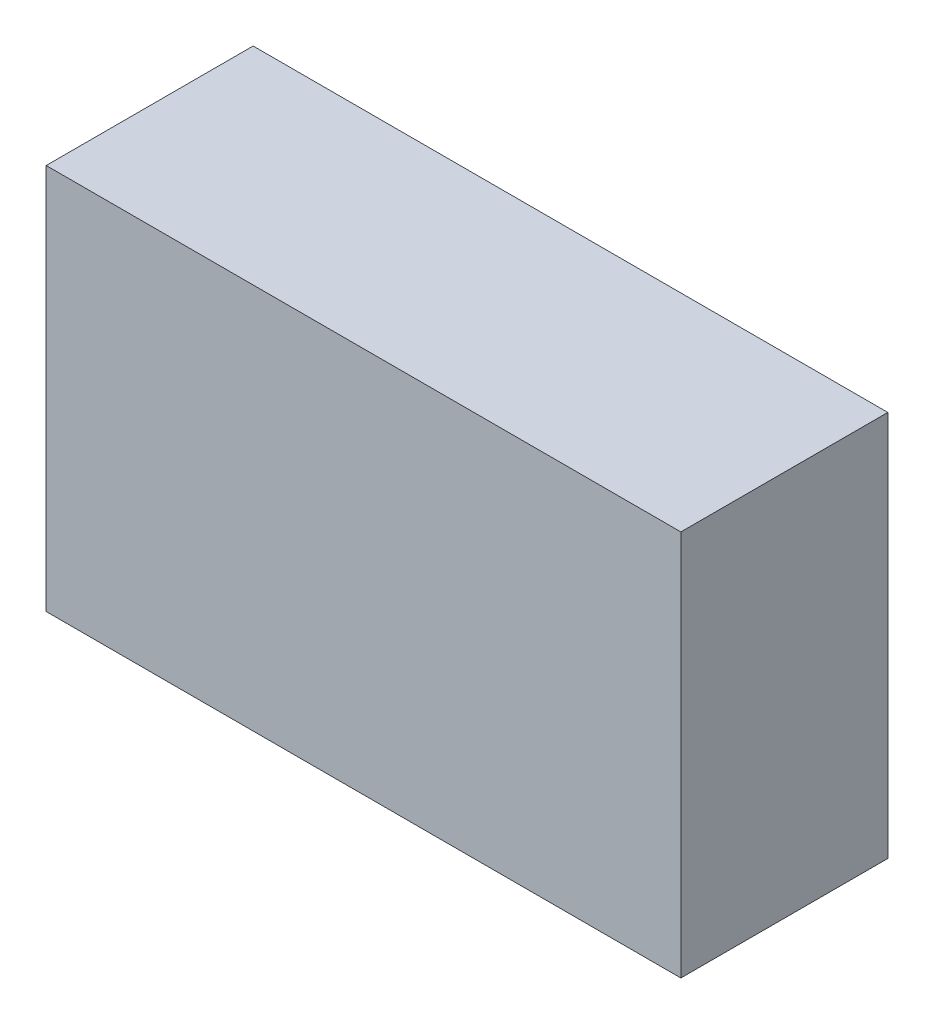
ISO-10303-21;
HEADER;
FILE_DESCRIPTION(('STEP AP214'),'2;1');
FILE_NAME('part.step','',(''),(''),'','','');
FILE_SCHEMA(('AUTOMOTIVE_DESIGN { 1 0 10303 214 1 1 1 1 }'));
ENDSEC;
DATA;
#1=APPLICATION_CONTEXT('core data for automotive mechanical design processes');
#2=APPLICATION_PROTOCOL_DEFINITION('international standard','automotive_design',2000,#1);
#3=PRODUCT_CONTEXT('',#1,'mechanical');
#4=PRODUCT('Part','Part','',(#3));
#5=PRODUCT_RELATED_PRODUCT_CATEGORY('part','',(#4));
#6=PRODUCT_DEFINITION_FORMATION('','',#4);
#7=PRODUCT_DEFINITION_CONTEXT('part definition',#1,'design');
#8=PRODUCT_DEFINITION('design','',#6,#7);
#9=PRODUCT_DEFINITION_SHAPE('','',#8);
#10=(LENGTH_UNIT() NAMED_UNIT(*) SI_UNIT(.MILLI.,.METRE.));
#11=(NAMED_UNIT(*) PLANE_ANGLE_UNIT() SI_UNIT($,.RADIAN.));
#12=(NAMED_UNIT(*) SI_UNIT($,.STERADIAN.) SOLID_ANGLE_UNIT());
#13=UNCERTAINTY_MEASURE_WITH_UNIT(LENGTH_MEASURE(1.E-05),#10,'distance_accuracy_value','');
#14=(GEOMETRIC_REPRESENTATION_CONTEXT(3) GLOBAL_UNCERTAINTY_ASSIGNED_CONTEXT((#13)) GLOBAL_UNIT_ASSIGNED_CONTEXT((#10,
#11,#12)) REPRESENTATION_CONTEXT('',''));
#15=CARTESIAN_POINT('',(0.,0.,0.));
#16=DIRECTION('',(0.,0.,1.));
#17=DIRECTION('',(1.,0.,0.));
#18=AXIS2_PLACEMENT_3D('',#15,#16,#17);
#19=CARTESIAN_POINT('',(0.,0.,15.));
#20=DIRECTION('',(1.,0.,0.));
#21=DIRECTION('',(0.,1.,0.));
#22=AXIS2_PLACEMENT_3D('',#19,#20,#21);
#23=PLANE('',#22);
#24=DIRECTION('',(0.,-1.,0.));
#25=VECTOR('',#24,1.);
#26=CARTESIAN_POINT('',(0.,0.,0.));
#27=LINE('',#26,#25);
#28=CARTESIAN_POINT('',(0.,28.,0.));
#29=VERTEX_POINT('',#28);
#30=CARTESIAN_POINT('',(0.,0.,0.));
#31=VERTEX_POINT('',#30);
#32=EDGE_CURVE('E96',#29,#31,#27,.T.);
#33=ORIENTED_EDGE('',*,*,#32,.T.);
#34=DIRECTION('',(0.,0.,-1.));
#35=VECTOR('',#34,1.);
#36=CARTESIAN_POINT('',(0.,0.,15.));
#37=LINE('',#36,#35);
#38=CARTESIAN_POINT('',(0.,0.,15.));
#39=VERTEX_POINT('',#38);
#40=EDGE_CURVE('E11',#39,#31,#37,.T.);
#41=ORIENTED_EDGE('',*,*,#40,.F.);
#42=DIRECTION('',(0.,-1.,0.));
#43=VECTOR('',#42,1.);
#44=CARTESIAN_POINT('',(0.,0.,15.));
#45=LINE('',#44,#43);
#46=CARTESIAN_POINT('',(0.,28.,15.));
#47=VERTEX_POINT('',#46);
#48=EDGE_CURVE('E84',#47,#39,#45,.T.);
#49=ORIENTED_EDGE('',*,*,#48,.F.);
#50=DIRECTION('',(0.,0.,-1.));
#51=VECTOR('',#50,1.);
#52=CARTESIAN_POINT('',(0.,28.,15.));
#53=LINE('',#52,#51);
#54=EDGE_CURVE('E92',#47,#29,#53,.T.);
#55=ORIENTED_EDGE('',*,*,#54,.T.);
#56=EDGE_LOOP('',(#33,#41,#49,#55));
#57=FACE_BOUND('',#56,.T.);
#58=ADVANCED_FACE('F33',(#57),#23,.F.);
#59=CARTESIAN_POINT('',(0.,0.,15.));
#60=DIRECTION('',(0.,1.,0.));
#61=DIRECTION('',(0.,0.,1.));
#62=AXIS2_PLACEMENT_3D('',#59,#60,#61);
#63=PLANE('',#62);
#64=DIRECTION('',(1.,0.,0.));
#65=VECTOR('',#64,1.);
#66=CARTESIAN_POINT('',(0.,0.,0.));
#67=LINE('',#66,#65);
#68=CARTESIAN_POINT('',(46.,0.,0.));
#69=VERTEX_POINT('',#68);
#70=EDGE_CURVE('E88',#31,#69,#67,.T.);
#71=ORIENTED_EDGE('',*,*,#70,.T.);
#72=DIRECTION('',(0.,0.,-1.));
#73=VECTOR('',#72,1.);
#74=CARTESIAN_POINT('',(46.,0.,15.));
#75=LINE('',#74,#73);
#76=CARTESIAN_POINT('',(46.,0.,15.));
#77=VERTEX_POINT('',#76);
#78=EDGE_CURVE('E41',#77,#69,#75,.T.);
#79=ORIENTED_EDGE('',*,*,#78,.F.);
#80=DIRECTION('',(1.,0.,0.));
#81=VECTOR('',#80,1.);
#82=CARTESIAN_POINT('',(0.,0.,15.));
#83=LINE('',#82,#81);
#84=EDGE_CURVE('E79',#39,#77,#83,.T.);
#85=ORIENTED_EDGE('',*,*,#84,.F.);
#86=ORIENTED_EDGE('',*,*,#40,.T.);
#87=EDGE_LOOP('',(#71,#79,#85,#86));
#88=FACE_BOUND('',#87,.T.);
#89=ADVANCED_FACE('F87',(#88),#63,.F.);
#90=CARTESIAN_POINT('',(46.,0.,15.));
#91=DIRECTION('',(-1.,0.,0.));
#92=DIRECTION('',(0.,0.,1.));
#93=AXIS2_PLACEMENT_3D('',#90,#91,#92);
#94=PLANE('',#93);
#95=DIRECTION('',(0.,1.,0.));
#96=VECTOR('',#95,1.);
#97=CARTESIAN_POINT('',(46.,0.,0.));
#98=LINE('',#97,#96);
#99=CARTESIAN_POINT('',(46.,28.,0.));
#100=VERTEX_POINT('',#99);
#101=EDGE_CURVE('E66',#69,#100,#98,.T.);
#102=ORIENTED_EDGE('',*,*,#101,.T.);
#103=DIRECTION('',(0.,0.,-1.));
#104=VECTOR('',#103,1.);
#105=CARTESIAN_POINT('',(46.,28.,15.));
#106=LINE('',#105,#104);
#107=CARTESIAN_POINT('',(46.,28.,15.));
#108=VERTEX_POINT('',#107);
#109=EDGE_CURVE('E89',#108,#100,#106,.T.);
#110=ORIENTED_EDGE('',*,*,#109,.F.);
#111=DIRECTION('',(0.,1.,0.));
#112=VECTOR('',#111,1.);
#113=CARTESIAN_POINT('',(46.,0.,15.));
#114=LINE('',#113,#112);
#115=EDGE_CURVE('E82',#77,#108,#114,.T.);
#116=ORIENTED_EDGE('',*,*,#115,.F.);
#117=ORIENTED_EDGE('',*,*,#78,.T.);
#118=EDGE_LOOP('',(#102,#110,#116,#117));
#119=FACE_BOUND('',#118,.T.);
#120=ADVANCED_FACE('F90',(#119),#94,.F.);
#121=CARTESIAN_POINT('',(0.,28.,15.));
#122=DIRECTION('',(0.,-1.,0.));
#123=DIRECTION('',(0.,0.,-1.));
#124=AXIS2_PLACEMENT_3D('',#121,#122,#123);
#125=PLANE('',#124);
#126=DIRECTION('',(-1.,0.,0.));
#127=VECTOR('',#126,1.);
#128=CARTESIAN_POINT('',(0.,28.,0.));
#129=LINE('',#128,#127);
#130=EDGE_CURVE('E72',#100,#29,#129,.T.);
#131=ORIENTED_EDGE('',*,*,#130,.T.);
#132=ORIENTED_EDGE('',*,*,#54,.F.);
#133=DIRECTION('',(-1.,0.,0.));
#134=VECTOR('',#133,1.);
#135=CARTESIAN_POINT('',(0.,28.,15.));
#136=LINE('',#135,#134);
#137=EDGE_CURVE('E49',#108,#47,#136,.T.);
#138=ORIENTED_EDGE('',*,*,#137,.F.);
#139=ORIENTED_EDGE('',*,*,#109,.T.);
#140=EDGE_LOOP('',(#131,#132,#138,#139));
#141=FACE_BOUND('',#140,.T.);
#142=ADVANCED_FACE('F103',(#141),#125,.F.);
#143=CARTESIAN_POINT('',(0.,0.,15.));
#144=DIRECTION('',(0.,0.,-1.));
#145=DIRECTION('',(-1.,0.,0.));
#146=AXIS2_PLACEMENT_3D('',#143,#144,#145);
#147=PLANE('',#146);
#148=ORIENTED_EDGE('',*,*,#48,.T.);
#149=ORIENTED_EDGE('',*,*,#84,.T.);
#150=ORIENTED_EDGE('',*,*,#115,.T.);
#151=ORIENTED_EDGE('',*,*,#137,.T.);
#152=EDGE_LOOP('',(#148,#149,#150,#151));
#153=FACE_BOUND('',#152,.T.);
#154=ADVANCED_FACE('F80',(#153),#147,.F.);
#155=CARTESIAN_POINT('',(0.,0.,0.));
#156=DIRECTION('',(0.,0.,-1.));
#157=DIRECTION('',(-1.,0.,0.));
#158=AXIS2_PLACEMENT_3D('',#155,#156,#157);
#159=PLANE('',#158);
#160=ORIENTED_EDGE('',*,*,#32,.F.);
#161=ORIENTED_EDGE('',*,*,#130,.F.);
#162=ORIENTED_EDGE('',*,*,#101,.F.);
#163=ORIENTED_EDGE('',*,*,#70,.F.);
#164=EDGE_LOOP('',(#160,#161,#162,#163));
#165=FACE_BOUND('',#164,.T.);
#166=ADVANCED_FACE('F106',(#165),#159,.T.);
#167=CLOSED_SHELL('',(#58,#89,#120,#142,#154,#166));
#168=MANIFOLD_SOLID_BREP('B2',#167);
#169=ADVANCED_BREP_SHAPE_REPRESENTATION('',(#18,#168),#14);
#170=SHAPE_DEFINITION_REPRESENTATION(#9,#169);
ENDSEC;
END-ISO-10303-21;
